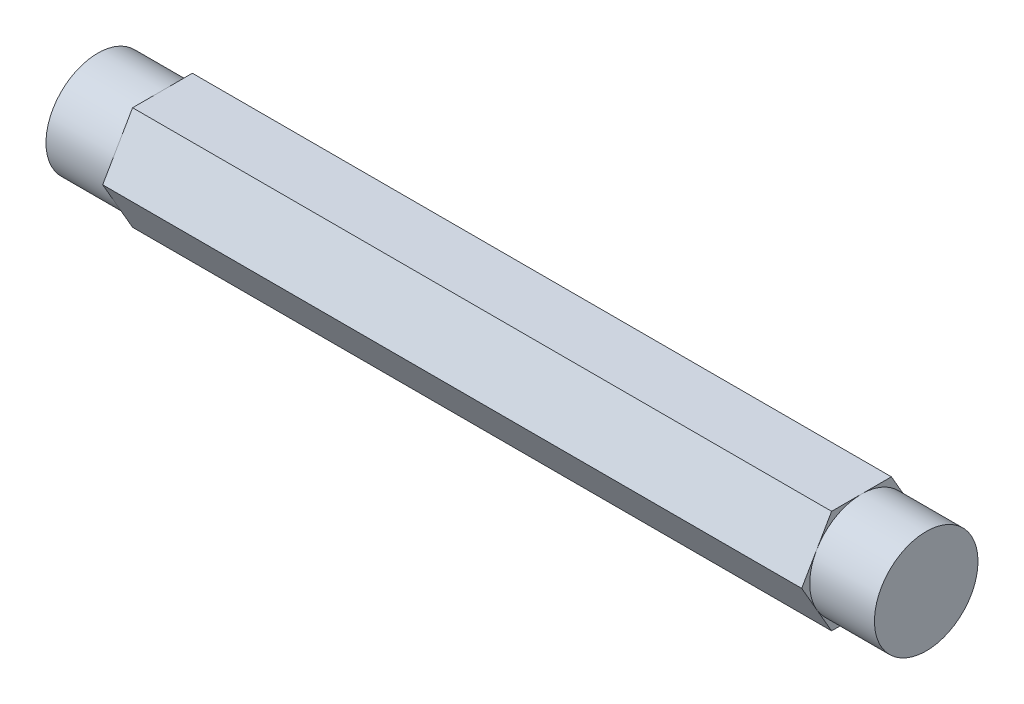
ISO-10303-21;
HEADER;
FILE_DESCRIPTION(('STEP AP214'),'2;1');
FILE_NAME('part.step','',(''),(''),'','','');
FILE_SCHEMA(('AUTOMOTIVE_DESIGN { 1 0 10303 214 1 1 1 1 }'));
ENDSEC;
DATA;
#1=APPLICATION_CONTEXT('core data for automotive mechanical design processes');
#2=APPLICATION_PROTOCOL_DEFINITION('international standard','automotive_design',2000,#1);
#3=PRODUCT_CONTEXT('',#1,'mechanical');
#4=PRODUCT('Part','Part','',(#3));
#5=PRODUCT_RELATED_PRODUCT_CATEGORY('part','',(#4));
#6=PRODUCT_DEFINITION_FORMATION('','',#4);
#7=PRODUCT_DEFINITION_CONTEXT('part definition',#1,'design');
#8=PRODUCT_DEFINITION('design','',#6,#7);
#9=PRODUCT_DEFINITION_SHAPE('','',#8);
#10=(LENGTH_UNIT() NAMED_UNIT(*) SI_UNIT(.MILLI.,.METRE.));
#11=(NAMED_UNIT(*) PLANE_ANGLE_UNIT() SI_UNIT($,.RADIAN.));
#12=(NAMED_UNIT(*) SI_UNIT($,.STERADIAN.) SOLID_ANGLE_UNIT());
#13=UNCERTAINTY_MEASURE_WITH_UNIT(LENGTH_MEASURE(1.E-05),#10,'distance_accuracy_value','');
#14=(GEOMETRIC_REPRESENTATION_CONTEXT(3) GLOBAL_UNCERTAINTY_ASSIGNED_CONTEXT((#13)) GLOBAL_UNIT_ASSIGNED_CONTEXT((#10,
#11,#12)) REPRESENTATION_CONTEXT('',''));
#15=CARTESIAN_POINT('',(0.,0.,0.));
#16=DIRECTION('',(0.,0.,1.));
#17=DIRECTION('',(1.,0.,0.));
#18=AXIS2_PLACEMENT_3D('',#15,#16,#17);
#19=CARTESIAN_POINT('',(50.8,-6.34999999999993,-3.66617420935418));
#20=DIRECTION('',(0.,0.499999999999995,0.866025403784441));
#21=DIRECTION('',(0.,-0.866025403784441,0.499999999999995));
#22=AXIS2_PLACEMENT_3D('',#19,#20,#21);
#23=PLANE('',#22);
#24=DIRECTION('',(-1.,0.,0.));
#25=VECTOR('',#24,1.);
#26=CARTESIAN_POINT('',(50.8,-6.34999999999993,-3.66617420935418));
#27=LINE('',#26,#25);
#28=CARTESIAN_POINT('',(42.8625,-6.34999999999993,-3.66617420935418));
#29=VERTEX_POINT('',#28);
#30=CARTESIAN_POINT('',(-42.8625,-6.34999999999993,-3.66617420935418));
#31=VERTEX_POINT('',#30);
#32=EDGE_CURVE('E201',#29,#31,#27,.T.);
#33=ORIENTED_EDGE('',*,*,#32,.T.);
#34=DIRECTION('',(0.,0.866025403784441,-0.499999999999995));
#35=VECTOR('',#34,1.);
#36=CARTESIAN_POINT('',(-42.8625,-6.34999999999993,-3.66617420935418));
#37=LINE('',#36,#35);
#38=CARTESIAN_POINT('',(-42.8625,-3.17499999999996,-5.49926131403118));
#39=VERTEX_POINT('',#38);
#40=EDGE_CURVE('E64',#31,#39,#37,.T.);
#41=ORIENTED_EDGE('',*,*,#40,.T.);
#42=CARTESIAN_POINT('',(-42.8625,0.,-7.33234841870822));
#43=VERTEX_POINT('',#42);
#44=EDGE_CURVE('E159',#39,#43,#37,.T.);
#45=ORIENTED_EDGE('',*,*,#44,.T.);
#46=DIRECTION('',(-1.,0.,0.));
#47=VECTOR('',#46,1.);
#48=CARTESIAN_POINT('',(50.8,0.,-7.33234841870822));
#49=LINE('',#48,#47);
#50=CARTESIAN_POINT('',(42.8625,0.,-7.33234841870822));
#51=VERTEX_POINT('',#50);
#52=EDGE_CURVE('E175',#51,#43,#49,.T.);
#53=ORIENTED_EDGE('',*,*,#52,.F.);
#54=DIRECTION('',(0.,0.866025403784441,-0.499999999999995));
#55=VECTOR('',#54,1.);
#56=CARTESIAN_POINT('',(42.8625,-6.34999999999993,-3.66617420935418));
#57=LINE('',#56,#55);
#58=CARTESIAN_POINT('',(42.8625,-3.17499999999996,-5.49926131403118));
#59=VERTEX_POINT('',#58);
#60=EDGE_CURVE('E198',#59,#51,#57,.T.);
#61=ORIENTED_EDGE('',*,*,#60,.F.);
#62=EDGE_CURVE('E200',#29,#59,#57,.T.);
#63=ORIENTED_EDGE('',*,*,#62,.F.);
#64=EDGE_LOOP('',(#33,#41,#45,#53,#61,#63));
#65=FACE_BOUND('',#64,.T.);
#66=ADVANCED_FACE('F50',(#65),#23,.F.);
#67=CARTESIAN_POINT('',(50.8,0.,-7.33234841870822));
#68=DIRECTION('',(0.,-0.500000000000001,0.866025403784438));
#69=DIRECTION('',(0.,-0.866025403784438,-0.500000000000001));
#70=AXIS2_PLACEMENT_3D('',#67,#68,#69);
#71=PLANE('',#70);
#72=ORIENTED_EDGE('',*,*,#52,.T.);
#73=DIRECTION('',(0.,0.866025403784438,0.500000000000001));
#74=VECTOR('',#73,1.);
#75=CARTESIAN_POINT('',(-42.8625,0.,-7.33234841870822));
#76=LINE('',#75,#74);
#77=CARTESIAN_POINT('',(-42.8625,3.17499999999999,-5.49926131403116));
#78=VERTEX_POINT('',#77);
#79=EDGE_CURVE('E152',#43,#78,#76,.T.);
#80=ORIENTED_EDGE('',*,*,#79,.T.);
#81=CARTESIAN_POINT('',(-42.8625,6.34999999999999,-3.6661742093541));
#82=VERTEX_POINT('',#81);
#83=EDGE_CURVE('E141',#78,#82,#76,.T.);
#84=ORIENTED_EDGE('',*,*,#83,.T.);
#85=DIRECTION('',(-1.,0.,0.));
#86=VECTOR('',#85,1.);
#87=CARTESIAN_POINT('',(50.8,6.34999999999999,-3.6661742093541));
#88=LINE('',#87,#86);
#89=CARTESIAN_POINT('',(42.8625,6.34999999999999,-3.6661742093541));
#90=VERTEX_POINT('',#89);
#91=EDGE_CURVE('E213',#90,#82,#88,.T.);
#92=ORIENTED_EDGE('',*,*,#91,.F.);
#93=DIRECTION('',(0.,0.866025403784438,0.500000000000001));
#94=VECTOR('',#93,1.);
#95=CARTESIAN_POINT('',(42.8625,0.,-7.33234841870822));
#96=LINE('',#95,#94);
#97=CARTESIAN_POINT('',(42.8625,3.17499999999999,-5.49926131403116));
#98=VERTEX_POINT('',#97);
#99=EDGE_CURVE('E195',#98,#90,#96,.T.);
#100=ORIENTED_EDGE('',*,*,#99,.F.);
#101=EDGE_CURVE('E197',#51,#98,#96,.T.);
#102=ORIENTED_EDGE('',*,*,#101,.F.);
#103=EDGE_LOOP('',(#72,#80,#84,#92,#100,#102));
#104=FACE_BOUND('',#103,.T.);
#105=ADVANCED_FACE('F172',(#104),#71,.F.);
#106=CARTESIAN_POINT('',(50.8,6.34999999999999,-3.6661742093541));
#107=DIRECTION('',(0.,-1.,0.));
#108=DIRECTION('',(0.,0.,-1.));
#109=AXIS2_PLACEMENT_3D('',#106,#107,#108);
#110=PLANE('',#109);
#111=ORIENTED_EDGE('',*,*,#91,.T.);
#112=DIRECTION('',(0.,0.,1.));
#113=VECTOR('',#112,1.);
#114=CARTESIAN_POINT('',(-42.8625,6.34999999999999,-3.6661742093541));
#115=LINE('',#114,#113);
#116=CARTESIAN_POINT('',(-42.8625,6.34999999999997,0.));
#117=VERTEX_POINT('',#116);
#118=EDGE_CURVE('E147',#82,#117,#115,.T.);
#119=ORIENTED_EDGE('',*,*,#118,.T.);
#120=CARTESIAN_POINT('',(-42.8625,6.34999999999996,3.66617420935414));
#121=VERTEX_POINT('',#120);
#122=EDGE_CURVE('E178',#117,#121,#115,.T.);
#123=ORIENTED_EDGE('',*,*,#122,.T.);
#124=DIRECTION('',(-1.,0.,0.));
#125=VECTOR('',#124,1.);
#126=CARTESIAN_POINT('',(50.8,6.34999999999996,3.66617420935414));
#127=LINE('',#126,#125);
#128=CARTESIAN_POINT('',(42.8625,6.34999999999996,3.66617420935414));
#129=VERTEX_POINT('',#128);
#130=EDGE_CURVE('E210',#129,#121,#127,.T.);
#131=ORIENTED_EDGE('',*,*,#130,.F.);
#132=DIRECTION('',(0.,0.,1.));
#133=VECTOR('',#132,1.);
#134=CARTESIAN_POINT('',(42.8625,6.34999999999999,-3.6661742093541));
#135=LINE('',#134,#133);
#136=CARTESIAN_POINT('',(42.8625,6.34999999999997,0.));
#137=VERTEX_POINT('',#136);
#138=EDGE_CURVE('E192',#137,#129,#135,.T.);
#139=ORIENTED_EDGE('',*,*,#138,.F.);
#140=EDGE_CURVE('E194',#90,#137,#135,.T.);
#141=ORIENTED_EDGE('',*,*,#140,.F.);
#142=EDGE_LOOP('',(#111,#119,#123,#131,#139,#141));
#143=FACE_BOUND('',#142,.T.);
#144=ADVANCED_FACE('F253',(#143),#110,.F.);
#145=CARTESIAN_POINT('',(50.8,6.34999999999996,3.66617420935414));
#146=DIRECTION('',(0.,-0.499999999999995,-0.866025403784442));
#147=DIRECTION('',(0.,0.866025403784442,-0.499999999999995));
#148=AXIS2_PLACEMENT_3D('',#145,#146,#147);
#149=PLANE('',#148);
#150=ORIENTED_EDGE('',*,*,#130,.T.);
#151=DIRECTION('',(0.,-0.866025403784442,0.499999999999995));
#152=VECTOR('',#151,1.);
#153=CARTESIAN_POINT('',(-42.8625,6.34999999999996,3.66617420935414));
#154=LINE('',#153,#152);
#155=CARTESIAN_POINT('',(-42.8625,3.17499999999995,5.49926131403118));
#156=VERTEX_POINT('',#155);
#157=EDGE_CURVE('E285',#121,#156,#154,.T.);
#158=ORIENTED_EDGE('',*,*,#157,.T.);
#159=CARTESIAN_POINT('',(-42.8625,0.,7.33234841870822));
#160=VERTEX_POINT('',#159);
#161=EDGE_CURVE('E284',#156,#160,#154,.T.);
#162=ORIENTED_EDGE('',*,*,#161,.T.);
#163=DIRECTION('',(-1.,0.,0.));
#164=VECTOR('',#163,1.);
#165=CARTESIAN_POINT('',(50.8,0.,7.33234841870822));
#166=LINE('',#165,#164);
#167=CARTESIAN_POINT('',(42.8625,0.,7.33234841870822));
#168=VERTEX_POINT('',#167);
#169=EDGE_CURVE('E207',#168,#160,#166,.T.);
#170=ORIENTED_EDGE('',*,*,#169,.F.);
#171=DIRECTION('',(0.,-0.866025403784442,0.499999999999995));
#172=VECTOR('',#171,1.);
#173=CARTESIAN_POINT('',(42.8625,6.34999999999996,3.66617420935414));
#174=LINE('',#173,#172);
#175=CARTESIAN_POINT('',(42.8625,3.17499999999995,5.49926131403118));
#176=VERTEX_POINT('',#175);
#177=EDGE_CURVE('E189',#176,#168,#174,.T.);
#178=ORIENTED_EDGE('',*,*,#177,.F.);
#179=EDGE_CURVE('E191',#129,#176,#174,.T.);
#180=ORIENTED_EDGE('',*,*,#179,.F.);
#181=EDGE_LOOP('',(#150,#158,#162,#170,#178,#180));
#182=FACE_BOUND('',#181,.T.);
#183=ADVANCED_FACE('F263',(#182),#149,.F.);
#184=CARTESIAN_POINT('',(50.8,0.,7.33234841870822));
#185=DIRECTION('',(0.,0.500000000000007,-0.866025403784435));
#186=DIRECTION('',(0.,0.866025403784435,0.500000000000007));
#187=AXIS2_PLACEMENT_3D('',#184,#185,#186);
#188=PLANE('',#187);
#189=ORIENTED_EDGE('',*,*,#169,.T.);
#190=DIRECTION('',(0.,-0.866025403784435,-0.500000000000007));
#191=VECTOR('',#190,1.);
#192=CARTESIAN_POINT('',(-42.8625,0.,7.33234841870822));
#193=LINE('',#192,#191);
#194=CARTESIAN_POINT('',(-42.8625,-3.17500000000003,5.49926131403114));
#195=VERTEX_POINT('',#194);
#196=EDGE_CURVE('E283',#160,#195,#193,.T.);
#197=ORIENTED_EDGE('',*,*,#196,.T.);
#198=CARTESIAN_POINT('',(-42.8625,-6.35000000000001,3.66617420935405));
#199=VERTEX_POINT('',#198);
#200=EDGE_CURVE('E170',#195,#199,#193,.T.);
#201=ORIENTED_EDGE('',*,*,#200,.T.);
#202=DIRECTION('',(-1.,0.,0.));
#203=VECTOR('',#202,1.);
#204=CARTESIAN_POINT('',(50.8,-6.35000000000001,3.66617420935405));
#205=LINE('',#204,#203);
#206=CARTESIAN_POINT('',(42.8625,-6.35000000000001,3.66617420935405));
#207=VERTEX_POINT('',#206);
#208=EDGE_CURVE('E204',#207,#199,#205,.T.);
#209=ORIENTED_EDGE('',*,*,#208,.F.);
#210=DIRECTION('',(0.,-0.866025403784435,-0.500000000000007));
#211=VECTOR('',#210,1.);
#212=CARTESIAN_POINT('',(42.8625,0.,7.33234841870822));
#213=LINE('',#212,#211);
#214=CARTESIAN_POINT('',(42.8625,-3.17500000000003,5.49926131403114));
#215=VERTEX_POINT('',#214);
#216=EDGE_CURVE('E184',#215,#207,#213,.T.);
#217=ORIENTED_EDGE('',*,*,#216,.F.);
#218=EDGE_CURVE('E188',#168,#215,#213,.T.);
#219=ORIENTED_EDGE('',*,*,#218,.F.);
#220=EDGE_LOOP('',(#189,#197,#201,#209,#217,#219));
#221=FACE_BOUND('',#220,.T.);
#222=ADVANCED_FACE('F272',(#221),#188,.F.);
#223=CARTESIAN_POINT('',(50.8,-6.35000000000001,3.66617420935405));
#224=DIRECTION('',(0.,1.,0.));
#225=DIRECTION('',(0.,0.,1.));
#226=AXIS2_PLACEMENT_3D('',#223,#224,#225);
#227=PLANE('',#226);
#228=ORIENTED_EDGE('',*,*,#208,.T.);
#229=DIRECTION('',(0.,0.,-1.));
#230=VECTOR('',#229,1.);
#231=CARTESIAN_POINT('',(-42.8625,-6.35000000000001,3.66617420935405));
#232=LINE('',#231,#230);
#233=CARTESIAN_POINT('',(-42.8625,-6.34999999999997,0.));
#234=VERTEX_POINT('',#233);
#235=EDGE_CURVE('E12',#199,#234,#232,.T.);
#236=ORIENTED_EDGE('',*,*,#235,.T.);
#237=EDGE_CURVE('E53',#234,#31,#232,.T.);
#238=ORIENTED_EDGE('',*,*,#237,.T.);
#239=ORIENTED_EDGE('',*,*,#32,.F.);
#240=DIRECTION('',(0.,0.,-1.));
#241=VECTOR('',#240,1.);
#242=CARTESIAN_POINT('',(42.8625,-6.35000000000001,3.66617420935405));
#243=LINE('',#242,#241);
#244=CARTESIAN_POINT('',(42.8625,-6.34999999999997,0.));
#245=VERTEX_POINT('',#244);
#246=EDGE_CURVE('E219',#245,#29,#243,.T.);
#247=ORIENTED_EDGE('',*,*,#246,.F.);
#248=EDGE_CURVE('E220',#207,#245,#243,.T.);
#249=ORIENTED_EDGE('',*,*,#248,.F.);
#250=EDGE_LOOP('',(#228,#236,#238,#239,#247,#249));
#251=FACE_BOUND('',#250,.T.);
#252=ADVANCED_FACE('F234',(#251),#227,.F.);
#253=CARTESIAN_POINT('',(42.8625,0.,0.));
#254=DIRECTION('',(1.,0.,0.));
#255=DIRECTION('',(0.,0.,-1.));
#256=AXIS2_PLACEMENT_3D('',#253,#254,#255);
#257=PLANE('',#256);
#258=ORIENTED_EDGE('',*,*,#62,.T.);
#259=CARTESIAN_POINT('',(42.8625,0.,0.));
#260=DIRECTION('',(1.,0.,0.));
#261=DIRECTION('',(0.,0.,-1.));
#262=AXIS2_PLACEMENT_3D('',#259,#260,#261);
#263=CIRCLE('',#262,6.34999999999997);
#264=EDGE_CURVE('E239',#245,#59,#263,.T.);
#265=ORIENTED_EDGE('',*,*,#264,.F.);
#266=ORIENTED_EDGE('',*,*,#246,.T.);
#267=EDGE_LOOP('',(#258,#265,#266));
#268=FACE_BOUND('',#267,.T.);
#269=ADVANCED_FACE('F237',(#268),#257,.T.);
#270=ORIENTED_EDGE('',*,*,#60,.T.);
#271=ORIENTED_EDGE('',*,*,#101,.T.);
#272=EDGE_CURVE('E186',#59,#98,#263,.T.);
#273=ORIENTED_EDGE('',*,*,#272,.F.);
#274=EDGE_LOOP('',(#270,#271,#273));
#275=FACE_BOUND('',#274,.T.);
#276=ADVANCED_FACE('F243',(#275),#257,.T.);
#277=ORIENTED_EDGE('',*,*,#99,.T.);
#278=ORIENTED_EDGE('',*,*,#140,.T.);
#279=EDGE_CURVE('E181',#98,#137,#263,.T.);
#280=ORIENTED_EDGE('',*,*,#279,.F.);
#281=EDGE_LOOP('',(#277,#278,#280));
#282=FACE_BOUND('',#281,.T.);
#283=ADVANCED_FACE('F249',(#282),#257,.T.);
#284=ORIENTED_EDGE('',*,*,#138,.T.);
#285=ORIENTED_EDGE('',*,*,#179,.T.);
#286=EDGE_CURVE('E185',#137,#176,#263,.T.);
#287=ORIENTED_EDGE('',*,*,#286,.F.);
#288=EDGE_LOOP('',(#284,#285,#287));
#289=FACE_BOUND('',#288,.T.);
#290=ADVANCED_FACE('F258',(#289),#257,.T.);
#291=ORIENTED_EDGE('',*,*,#177,.T.);
#292=ORIENTED_EDGE('',*,*,#218,.T.);
#293=EDGE_CURVE('E270',#176,#215,#263,.T.);
#294=ORIENTED_EDGE('',*,*,#293,.F.);
#295=EDGE_LOOP('',(#291,#292,#294));
#296=FACE_BOUND('',#295,.T.);
#297=ADVANCED_FACE('F269',(#296),#257,.T.);
#298=ORIENTED_EDGE('',*,*,#216,.T.);
#299=ORIENTED_EDGE('',*,*,#248,.T.);
#300=EDGE_CURVE('E72',#215,#245,#263,.T.);
#301=ORIENTED_EDGE('',*,*,#300,.F.);
#302=EDGE_LOOP('',(#298,#299,#301));
#303=FACE_BOUND('',#302,.T.);
#304=ADVANCED_FACE('F229',(#303),#257,.T.);
#305=CARTESIAN_POINT('',(42.8625,0.,0.));
#306=DIRECTION('',(1.,0.,0.));
#307=DIRECTION('',(0.,0.,-1.));
#308=AXIS2_PLACEMENT_3D('',#305,#306,#307);
#309=CYLINDRICAL_SURFACE('',#308,6.34999999999997);
#310=CARTESIAN_POINT('',(50.8,0.,0.));
#311=DIRECTION('',(1.,0.,0.));
#312=DIRECTION('',(0.,0.,-1.));
#313=AXIS2_PLACEMENT_3D('',#310,#311,#312);
#314=CIRCLE('',#313,6.34999999999997);
#315=CARTESIAN_POINT('',(50.8,0.,-6.34999999999997));
#316=VERTEX_POINT('',#315);
#317=EDGE_CURVE('E216',#316,#316,#314,.T.);
#318=ORIENTED_EDGE('',*,*,#317,.F.);
#319=EDGE_LOOP('',(#318));
#320=FACE_BOUND('',#319,.T.);
#321=ORIENTED_EDGE('',*,*,#264,.T.);
#322=ORIENTED_EDGE('',*,*,#272,.T.);
#323=ORIENTED_EDGE('',*,*,#279,.T.);
#324=ORIENTED_EDGE('',*,*,#286,.T.);
#325=ORIENTED_EDGE('',*,*,#293,.T.);
#326=ORIENTED_EDGE('',*,*,#300,.T.);
#327=EDGE_LOOP('',(#321,#322,#323,#324,#325,#326));
#328=FACE_BOUND('',#327,.T.);
#329=ADVANCED_FACE('F320',(#320,#328),#309,.T.);
#330=CARTESIAN_POINT('',(50.8,0.,0.));
#331=DIRECTION('',(1.,0.,0.));
#332=DIRECTION('',(0.,0.,-1.));
#333=AXIS2_PLACEMENT_3D('',#330,#331,#332);
#334=PLANE('',#333);
#335=ORIENTED_EDGE('',*,*,#317,.T.);
#336=EDGE_LOOP('',(#335));
#337=FACE_BOUND('',#336,.T.);
#338=ADVANCED_FACE('F317',(#337),#334,.T.);
#339=CARTESIAN_POINT('',(-42.8625,0.,0.));
#340=DIRECTION('',(1.,0.,0.));
#341=DIRECTION('',(0.,0.,-1.));
#342=AXIS2_PLACEMENT_3D('',#339,#340,#341);
#343=PLANE('',#342);
#344=ORIENTED_EDGE('',*,*,#237,.F.);
#345=CARTESIAN_POINT('',(-42.8625,0.,0.));
#346=DIRECTION('',(1.,0.,0.));
#347=DIRECTION('',(0.,0.,-1.));
#348=AXIS2_PLACEMENT_3D('',#345,#346,#347);
#349=CIRCLE('',#348,6.34999999999997);
#350=EDGE_CURVE('E162',#234,#39,#349,.T.);
#351=ORIENTED_EDGE('',*,*,#350,.T.);
#352=ORIENTED_EDGE('',*,*,#40,.F.);
#353=EDGE_LOOP('',(#344,#351,#352));
#354=FACE_BOUND('',#353,.T.);
#355=ADVANCED_FACE('F296',(#354),#343,.F.);
#356=EDGE_CURVE('E156',#39,#78,#349,.T.);
#357=ORIENTED_EDGE('',*,*,#356,.T.);
#358=ORIENTED_EDGE('',*,*,#79,.F.);
#359=ORIENTED_EDGE('',*,*,#44,.F.);
#360=EDGE_LOOP('',(#357,#358,#359));
#361=FACE_BOUND('',#360,.T.);
#362=ADVANCED_FACE('F157',(#361),#343,.F.);
#363=EDGE_CURVE('E145',#78,#117,#349,.T.);
#364=ORIENTED_EDGE('',*,*,#363,.T.);
#365=ORIENTED_EDGE('',*,*,#118,.F.);
#366=ORIENTED_EDGE('',*,*,#83,.F.);
#367=EDGE_LOOP('',(#364,#365,#366));
#368=FACE_BOUND('',#367,.T.);
#369=ADVANCED_FACE('F143',(#368),#343,.F.);
#370=EDGE_CURVE('E169',#117,#156,#349,.T.);
#371=ORIENTED_EDGE('',*,*,#370,.T.);
#372=ORIENTED_EDGE('',*,*,#157,.F.);
#373=ORIENTED_EDGE('',*,*,#122,.F.);
#374=EDGE_LOOP('',(#371,#372,#373));
#375=FACE_BOUND('',#374,.T.);
#376=ADVANCED_FACE('F289',(#375),#343,.F.);
#377=EDGE_CURVE('E281',#156,#195,#349,.T.);
#378=ORIENTED_EDGE('',*,*,#377,.T.);
#379=ORIENTED_EDGE('',*,*,#196,.F.);
#380=ORIENTED_EDGE('',*,*,#161,.F.);
#381=EDGE_LOOP('',(#378,#379,#380));
#382=FACE_BOUND('',#381,.T.);
#383=ADVANCED_FACE('F287',(#382),#343,.F.);
#384=EDGE_CURVE('E279',#195,#234,#349,.T.);
#385=ORIENTED_EDGE('',*,*,#384,.T.);
#386=ORIENTED_EDGE('',*,*,#235,.F.);
#387=ORIENTED_EDGE('',*,*,#200,.F.);
#388=EDGE_LOOP('',(#385,#386,#387));
#389=FACE_BOUND('',#388,.T.);
#390=ADVANCED_FACE('F277',(#389),#343,.F.);
#391=CARTESIAN_POINT('',(-42.8625,0.,0.));
#392=DIRECTION('',(-1.,0.,0.));
#393=DIRECTION('',(0.,0.,1.));
#394=AXIS2_PLACEMENT_3D('',#391,#392,#393);
#395=CYLINDRICAL_SURFACE('',#394,6.34999999999997);
#396=ORIENTED_EDGE('',*,*,#356,.F.);
#397=ORIENTED_EDGE('',*,*,#350,.F.);
#398=ORIENTED_EDGE('',*,*,#384,.F.);
#399=ORIENTED_EDGE('',*,*,#377,.F.);
#400=ORIENTED_EDGE('',*,*,#370,.F.);
#401=ORIENTED_EDGE('',*,*,#363,.F.);
#402=EDGE_LOOP('',(#396,#397,#398,#399,#400,#401));
#403=FACE_BOUND('',#402,.T.);
#404=CARTESIAN_POINT('',(-50.8,0.,0.));
#405=DIRECTION('',(1.,0.,0.));
#406=DIRECTION('',(0.,0.,-1.));
#407=AXIS2_PLACEMENT_3D('',#404,#405,#406);
#408=CIRCLE('',#407,6.34999999999997);
#409=CARTESIAN_POINT('',(-50.8,0.,-6.34999999999997));
#410=VERTEX_POINT('',#409);
#411=EDGE_CURVE('E221',#410,#410,#408,.F.);
#412=ORIENTED_EDGE('',*,*,#411,.F.);
#413=EDGE_LOOP('',(#412));
#414=FACE_BOUND('',#413,.T.);
#415=ADVANCED_FACE('F165',(#403,#414),#395,.T.);
#416=CARTESIAN_POINT('',(-50.8,0.,0.));
#417=DIRECTION('',(1.,0.,0.));
#418=DIRECTION('',(0.,0.,-1.));
#419=AXIS2_PLACEMENT_3D('',#416,#417,#418);
#420=PLANE('',#419);
#421=ORIENTED_EDGE('',*,*,#411,.T.);
#422=EDGE_LOOP('',(#421));
#423=FACE_BOUND('',#422,.T.);
#424=ADVANCED_FACE('F314',(#423),#420,.F.);
#425=CLOSED_SHELL('',(#66,#105,#144,#183,#222,#252,#269,#276,#283,#290,#297,#304,#329,#338,#355,
#362,#369,#376,#383,#390,#415,#424));
#426=MANIFOLD_SOLID_BREP('B2',#425);
#427=ADVANCED_BREP_SHAPE_REPRESENTATION('',(#18,#426),#14);
#428=SHAPE_DEFINITION_REPRESENTATION(#9,#427);
ENDSEC;
END-ISO-10303-21;
